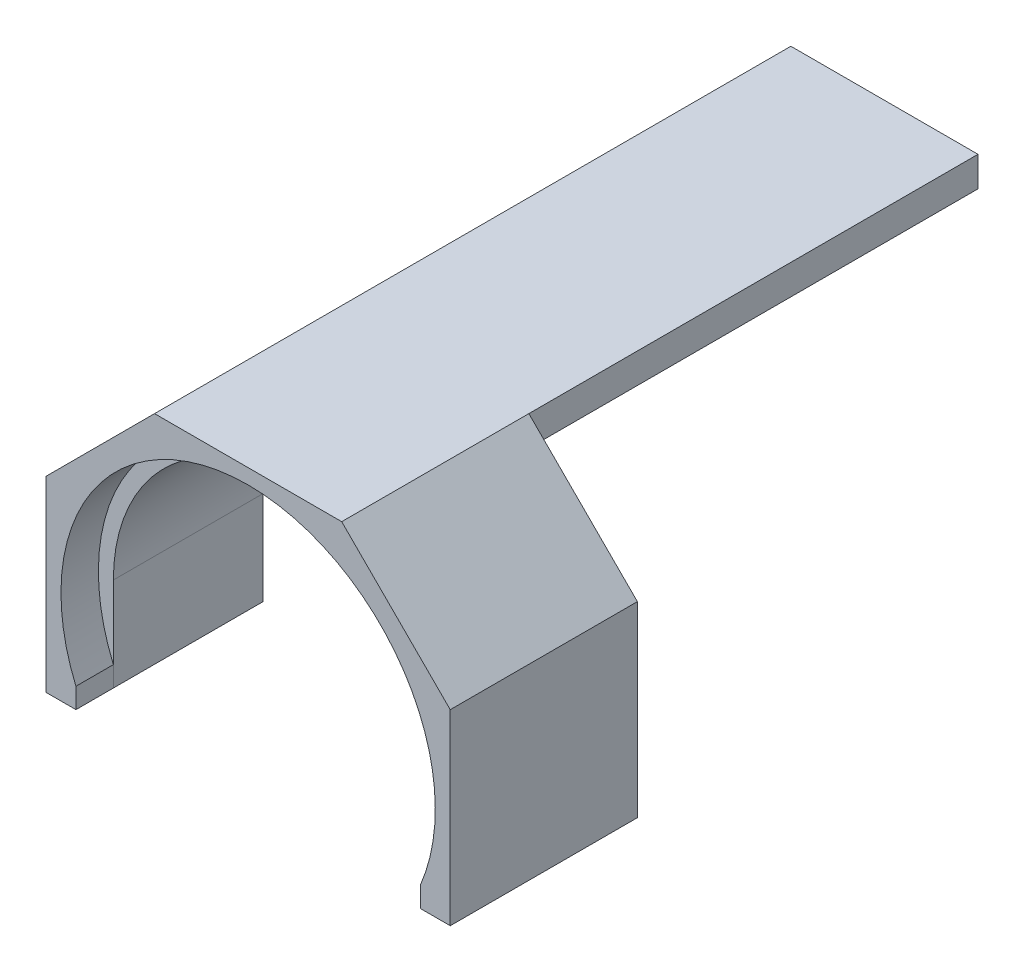
ISO-10303-21;
HEADER;
FILE_DESCRIPTION(('STEP AP214'),'2;1');
FILE_NAME('part.step','',(''),(''),'','','');
FILE_SCHEMA(('AUTOMOTIVE_DESIGN { 1 0 10303 214 1 1 1 1 }'));
ENDSEC;
DATA;
#1=APPLICATION_CONTEXT('core data for automotive mechanical design processes');
#2=APPLICATION_PROTOCOL_DEFINITION('international standard','automotive_design',2000,#1);
#3=PRODUCT_CONTEXT('',#1,'mechanical');
#4=PRODUCT('Part','Part','',(#3));
#5=PRODUCT_RELATED_PRODUCT_CATEGORY('part','',(#4));
#6=PRODUCT_DEFINITION_FORMATION('','',#4);
#7=PRODUCT_DEFINITION_CONTEXT('part definition',#1,'design');
#8=PRODUCT_DEFINITION('design','',#6,#7);
#9=PRODUCT_DEFINITION_SHAPE('','',#8);
#10=(LENGTH_UNIT() NAMED_UNIT(*) SI_UNIT(.MILLI.,.METRE.));
#11=(NAMED_UNIT(*) PLANE_ANGLE_UNIT() SI_UNIT($,.RADIAN.));
#12=(NAMED_UNIT(*) SI_UNIT($,.STERADIAN.) SOLID_ANGLE_UNIT());
#13=UNCERTAINTY_MEASURE_WITH_UNIT(LENGTH_MEASURE(1.E-05),#10,'distance_accuracy_value','');
#14=(GEOMETRIC_REPRESENTATION_CONTEXT(3) GLOBAL_UNCERTAINTY_ASSIGNED_CONTEXT((#13)) GLOBAL_UNIT_ASSIGNED_CONTEXT((#10,
#11,#12)) REPRESENTATION_CONTEXT('',''));
#15=CARTESIAN_POINT('',(0.,0.,0.));
#16=DIRECTION('',(0.,0.,1.));
#17=DIRECTION('',(1.,0.,0.));
#18=AXIS2_PLACEMENT_3D('',#15,#16,#17);
#19=CARTESIAN_POINT('',(0.,0.,160.));
#20=DIRECTION('',(0.,0.,1.));
#21=DIRECTION('',(1.,0.,0.));
#22=AXIS2_PLACEMENT_3D('',#19,#20,#21);
#23=PLANE('',#22);
#24=CARTESIAN_POINT('',(0.,-50.,160.));
#25=DIRECTION('',(0.,0.,-1.));
#26=DIRECTION('',(1.,0.,0.));
#27=AXIS2_PLACEMENT_3D('',#24,#25,#26);
#28=CIRCLE('',#27,50.);
#29=CARTESIAN_POINT('',(-46.0023323000082,-69.5849645146475,160.));
#30=VERTEX_POINT('',#29);
#31=CARTESIAN_POINT('',(46.,-69.5959179422654,160.));
#32=VERTEX_POINT('',#31);
#33=EDGE_CURVE('E54',#30,#32,#28,.T.);
#34=ORIENTED_EDGE('',*,*,#33,.F.);
#35=DIRECTION('',(0.,1.,0.));
#36=VECTOR('',#35,1.);
#37=CARTESIAN_POINT('',(-46.,-50.,160.));
#38=LINE('',#37,#36);
#39=CARTESIAN_POINT('',(-46.,-50.,160.));
#40=VERTEX_POINT('',#39);
#41=EDGE_CURVE('E175',#30,#40,#38,.T.);
#42=ORIENTED_EDGE('',*,*,#41,.T.);
#43=CARTESIAN_POINT('',(0.,-50.,160.));
#44=DIRECTION('',(0.,0.,-1.));
#45=DIRECTION('',(1.,0.,0.));
#46=AXIS2_PLACEMENT_3D('',#43,#44,#45);
#47=CIRCLE('',#46,46.);
#48=CARTESIAN_POINT('',(46.,-50.,160.));
#49=VERTEX_POINT('',#48);
#50=EDGE_CURVE('E402',#40,#49,#47,.T.);
#51=ORIENTED_EDGE('',*,*,#50,.T.);
#52=DIRECTION('',(0.,-1.,0.));
#53=VECTOR('',#52,1.);
#54=CARTESIAN_POINT('',(46.,-50.,160.));
#55=LINE('',#54,#53);
#56=EDGE_CURVE('E401',#49,#32,#55,.T.);
#57=ORIENTED_EDGE('',*,*,#56,.T.);
#58=EDGE_LOOP('',(#34,#42,#51,#57));
#59=FACE_BOUND('',#58,.T.);
#60=ADVANCED_FACE('F36',(#59),#23,.T.);
#61=CARTESIAN_POINT('',(-25.,4.,0.));
#62=DIRECTION('',(-1.,0.,0.));
#63=DIRECTION('',(0.,0.,1.));
#64=AXIS2_PLACEMENT_3D('',#61,#62,#63);
#65=PLANE('',#64);
#66=DIRECTION('',(0.,0.,1.));
#67=VECTOR('',#66,1.);
#68=CARTESIAN_POINT('',(-25.,-4.,0.));
#69=LINE('',#68,#67);
#70=CARTESIAN_POINT('',(-25.,-4.,0.));
#71=VERTEX_POINT('',#70);
#72=CARTESIAN_POINT('',(-25.,-4.,120.));
#73=VERTEX_POINT('',#72);
#74=EDGE_CURVE('E358',#71,#73,#69,.T.);
#75=ORIENTED_EDGE('',*,*,#74,.T.);
#76=DIRECTION('',(0.,1.,0.));
#77=VECTOR('',#76,1.);
#78=CARTESIAN_POINT('',(-25.,4.,120.));
#79=LINE('',#78,#77);
#80=CARTESIAN_POINT('',(-25.,4.,120.));
#81=VERTEX_POINT('',#80);
#82=EDGE_CURVE('E351',#73,#81,#79,.T.);
#83=ORIENTED_EDGE('',*,*,#82,.T.);
#84=DIRECTION('',(0.,0.,1.));
#85=VECTOR('',#84,1.);
#86=CARTESIAN_POINT('',(-25.,4.,0.));
#87=LINE('',#86,#85);
#88=CARTESIAN_POINT('',(-25.,4.,0.));
#89=VERTEX_POINT('',#88);
#90=EDGE_CURVE('E361',#89,#81,#87,.T.);
#91=ORIENTED_EDGE('',*,*,#90,.F.);
#92=DIRECTION('',(0.,-1.,0.));
#93=VECTOR('',#92,1.);
#94=CARTESIAN_POINT('',(-25.,4.,0.));
#95=LINE('',#94,#93);
#96=EDGE_CURVE('E354',#89,#71,#95,.T.);
#97=ORIENTED_EDGE('',*,*,#96,.T.);
#98=EDGE_LOOP('',(#75,#83,#91,#97));
#99=FACE_BOUND('',#98,.T.);
#100=ADVANCED_FACE('F267',(#99),#65,.T.);
#101=CARTESIAN_POINT('',(-25.,-4.,0.));
#102=DIRECTION('',(0.,-1.,0.));
#103=DIRECTION('',(1.,0.,0.));
#104=AXIS2_PLACEMENT_3D('',#101,#102,#103);
#105=PLANE('',#104);
#106=DIRECTION('',(0.,0.,1.));
#107=VECTOR('',#106,1.);
#108=CARTESIAN_POINT('',(25.,-4.,0.));
#109=LINE('',#108,#107);
#110=CARTESIAN_POINT('',(25.,-4.,0.));
#111=VERTEX_POINT('',#110);
#112=CARTESIAN_POINT('',(25.,-4.,120.));
#113=VERTEX_POINT('',#112);
#114=EDGE_CURVE('E46',#111,#113,#109,.T.);
#115=ORIENTED_EDGE('',*,*,#114,.T.);
#116=DIRECTION('',(-1.,0.,0.));
#117=VECTOR('',#116,1.);
#118=CARTESIAN_POINT('',(-25.,-4.,120.));
#119=LINE('',#118,#117);
#120=CARTESIAN_POINT('',(0.,-4.,120.));
#121=VERTEX_POINT('',#120);
#122=EDGE_CURVE('E347',#113,#121,#119,.T.);
#123=ORIENTED_EDGE('',*,*,#122,.T.);
#124=EDGE_CURVE('E350',#121,#73,#119,.T.);
#125=ORIENTED_EDGE('',*,*,#124,.T.);
#126=ORIENTED_EDGE('',*,*,#74,.F.);
#127=DIRECTION('',(1.,0.,0.));
#128=VECTOR('',#127,1.);
#129=CARTESIAN_POINT('',(-25.,-4.,0.));
#130=LINE('',#129,#128);
#131=EDGE_CURVE('E357',#71,#111,#130,.T.);
#132=ORIENTED_EDGE('',*,*,#131,.T.);
#133=EDGE_LOOP('',(#115,#123,#125,#126,#132));
#134=FACE_BOUND('',#133,.T.);
#135=ADVANCED_FACE('F274',(#134),#105,.T.);
#136=CARTESIAN_POINT('',(25.,4.,0.));
#137=DIRECTION('',(1.,0.,0.));
#138=DIRECTION('',(0.,0.,-1.));
#139=AXIS2_PLACEMENT_3D('',#136,#137,#138);
#140=PLANE('',#139);
#141=DIRECTION('',(0.,0.,1.));
#142=VECTOR('',#141,1.);
#143=CARTESIAN_POINT('',(25.,4.,0.));
#144=LINE('',#143,#142);
#145=CARTESIAN_POINT('',(25.,4.,0.));
#146=VERTEX_POINT('',#145);
#147=CARTESIAN_POINT('',(25.,4.,120.));
#148=VERTEX_POINT('',#147);
#149=EDGE_CURVE('E11',#146,#148,#144,.T.);
#150=ORIENTED_EDGE('',*,*,#149,.T.);
#151=DIRECTION('',(0.,-1.,0.));
#152=VECTOR('',#151,1.);
#153=CARTESIAN_POINT('',(25.,4.,120.));
#154=LINE('',#153,#152);
#155=EDGE_CURVE('E331',#148,#113,#154,.T.);
#156=ORIENTED_EDGE('',*,*,#155,.T.);
#157=ORIENTED_EDGE('',*,*,#114,.F.);
#158=DIRECTION('',(0.,1.,0.));
#159=VECTOR('',#158,1.);
#160=CARTESIAN_POINT('',(25.,4.,0.));
#161=LINE('',#160,#159);
#162=EDGE_CURVE('E366',#111,#146,#161,.T.);
#163=ORIENTED_EDGE('',*,*,#162,.T.);
#164=EDGE_LOOP('',(#150,#156,#157,#163));
#165=FACE_BOUND('',#164,.T.);
#166=ADVANCED_FACE('F271',(#165),#140,.T.);
#167=CARTESIAN_POINT('',(0.,0.,0.));
#168=DIRECTION('',(0.,0.,1.));
#169=DIRECTION('',(1.,0.,0.));
#170=AXIS2_PLACEMENT_3D('',#167,#168,#169);
#171=PLANE('',#170);
#172=ORIENTED_EDGE('',*,*,#96,.F.);
#173=DIRECTION('',(-1.,0.,0.));
#174=VECTOR('',#173,1.);
#175=CARTESIAN_POINT('',(-25.,4.,0.));
#176=LINE('',#175,#174);
#177=EDGE_CURVE('E62',#146,#89,#176,.T.);
#178=ORIENTED_EDGE('',*,*,#177,.F.);
#179=ORIENTED_EDGE('',*,*,#162,.F.);
#180=ORIENTED_EDGE('',*,*,#131,.F.);
#181=EDGE_LOOP('',(#172,#178,#179,#180));
#182=FACE_BOUND('',#181,.T.);
#183=ADVANCED_FACE('F38',(#182),#171,.F.);
#184=CARTESIAN_POINT('',(-25.,4.,0.));
#185=DIRECTION('',(0.,1.,0.));
#186=DIRECTION('',(0.,0.,1.));
#187=AXIS2_PLACEMENT_3D('',#184,#185,#186);
#188=PLANE('',#187);
#189=DIRECTION('',(0.,0.,1.));
#190=VECTOR('',#189,1.);
#191=CARTESIAN_POINT('',(25.,4.,120.));
#192=LINE('',#191,#190);
#193=CARTESIAN_POINT('',(25.,4.,170.));
#194=VERTEX_POINT('',#193);
#195=EDGE_CURVE('E329',#148,#194,#192,.T.);
#196=ORIENTED_EDGE('',*,*,#195,.F.);
#197=ORIENTED_EDGE('',*,*,#149,.F.);
#198=ORIENTED_EDGE('',*,*,#177,.T.);
#199=ORIENTED_EDGE('',*,*,#90,.T.);
#200=DIRECTION('',(0.,0.,1.));
#201=VECTOR('',#200,1.);
#202=CARTESIAN_POINT('',(-25.,4.,120.));
#203=LINE('',#202,#201);
#204=CARTESIAN_POINT('',(-25.,4.,170.));
#205=VERTEX_POINT('',#204);
#206=EDGE_CURVE('E342',#81,#205,#203,.T.);
#207=ORIENTED_EDGE('',*,*,#206,.T.);
#208=DIRECTION('',(-1.,0.,0.));
#209=VECTOR('',#208,1.);
#210=CARTESIAN_POINT('',(-25.,4.,170.));
#211=LINE('',#210,#209);
#212=EDGE_CURVE('E312',#194,#205,#211,.T.);
#213=ORIENTED_EDGE('',*,*,#212,.F.);
#214=EDGE_LOOP('',(#196,#197,#198,#199,#207,#213));
#215=FACE_BOUND('',#214,.T.);
#216=ADVANCED_FACE('F228',(#215),#188,.T.);
#217=CARTESIAN_POINT('',(0.,-50.,120.));
#218=DIRECTION('',(0.,0.,1.));
#219=DIRECTION('',(1.,0.,0.));
#220=AXIS2_PLACEMENT_3D('',#217,#218,#219);
#221=CYLINDRICAL_SURFACE('',#220,46.);
#222=CARTESIAN_POINT('',(0.,-50.,120.));
#223=DIRECTION('',(0.,0.,-1.));
#224=DIRECTION('',(1.,0.,0.));
#225=AXIS2_PLACEMENT_3D('',#222,#223,#224);
#226=CIRCLE('',#225,46.);
#227=CARTESIAN_POINT('',(-46.,-50.,120.));
#228=VERTEX_POINT('',#227);
#229=EDGE_CURVE('E387',#228,#121,#226,.T.);
#230=ORIENTED_EDGE('',*,*,#229,.T.);
#231=CARTESIAN_POINT('',(46.,-50.,120.));
#232=VERTEX_POINT('',#231);
#233=EDGE_CURVE('E382',#121,#232,#226,.T.);
#234=ORIENTED_EDGE('',*,*,#233,.T.);
#235=DIRECTION('',(0.,0.,1.));
#236=VECTOR('',#235,1.);
#237=CARTESIAN_POINT('',(46.,-50.,120.));
#238=LINE('',#237,#236);
#239=EDGE_CURVE('E337',#232,#49,#238,.T.);
#240=ORIENTED_EDGE('',*,*,#239,.T.);
#241=ORIENTED_EDGE('',*,*,#50,.F.);
#242=DIRECTION('',(0.,0.,1.));
#243=VECTOR('',#242,1.);
#244=CARTESIAN_POINT('',(-46.,-50.,120.));
#245=LINE('',#244,#243);
#246=EDGE_CURVE('E339',#228,#40,#245,.T.);
#247=ORIENTED_EDGE('',*,*,#246,.F.);
#248=EDGE_LOOP('',(#230,#234,#240,#241,#247));
#249=FACE_BOUND('',#248,.T.);
#250=ADVANCED_FACE('F225',(#249),#221,.F.);
#251=CARTESIAN_POINT('',(0.,-50.,120.));
#252=DIRECTION('',(0.,0.,1.));
#253=DIRECTION('',(1.,0.,0.));
#254=AXIS2_PLACEMENT_3D('',#251,#252,#253);
#255=PLANE('',#254);
#256=ORIENTED_EDGE('',*,*,#82,.F.);
#257=ORIENTED_EDGE('',*,*,#124,.F.);
#258=ORIENTED_EDGE('',*,*,#229,.F.);
#259=DIRECTION('',(0.,1.,0.));
#260=VECTOR('',#259,1.);
#261=CARTESIAN_POINT('',(-46.,-50.,120.));
#262=LINE('',#261,#260);
#263=CARTESIAN_POINT('',(-46.,-75.,120.));
#264=VERTEX_POINT('',#263);
#265=EDGE_CURVE('E388',#264,#228,#262,.T.);
#266=ORIENTED_EDGE('',*,*,#265,.F.);
#267=DIRECTION('',(1.,0.,0.));
#268=VECTOR('',#267,1.);
#269=CARTESIAN_POINT('',(-54.,-75.,120.));
#270=LINE('',#269,#268);
#271=CARTESIAN_POINT('',(-54.,-75.,120.));
#272=VERTEX_POINT('',#271);
#273=EDGE_CURVE('E410',#272,#264,#270,.T.);
#274=ORIENTED_EDGE('',*,*,#273,.F.);
#275=DIRECTION('',(0.,-1.,0.));
#276=VECTOR('',#275,1.);
#277=CARTESIAN_POINT('',(-54.,-25.,120.));
#278=LINE('',#277,#276);
#279=CARTESIAN_POINT('',(-54.,-25.,120.));
#280=VERTEX_POINT('',#279);
#281=EDGE_CURVE('E297',#280,#272,#278,.T.);
#282=ORIENTED_EDGE('',*,*,#281,.F.);
#283=DIRECTION('',(-0.707106781186548,-0.707106781186548,0.));
#284=VECTOR('',#283,1.);
#285=CARTESIAN_POINT('',(-54.,-25.,120.));
#286=LINE('',#285,#284);
#287=EDGE_CURVE('E380',#81,#280,#286,.T.);
#288=ORIENTED_EDGE('',*,*,#287,.F.);
#289=EDGE_LOOP('',(#256,#257,#258,#266,#274,#282,#288));
#290=FACE_BOUND('',#289,.T.);
#291=ADVANCED_FACE('F209',(#290),#255,.F.);
#292=CARTESIAN_POINT('',(25.,4.,120.));
#293=DIRECTION('',(0.707106781186548,0.707106781186548,0.));
#294=DIRECTION('',(-0.707106781186548,0.707106781186548,0.));
#295=AXIS2_PLACEMENT_3D('',#292,#293,#294);
#296=PLANE('',#295);
#297=ORIENTED_EDGE('',*,*,#195,.T.);
#298=DIRECTION('',(-0.707106781186548,0.707106781186548,0.));
#299=VECTOR('',#298,1.);
#300=CARTESIAN_POINT('',(25.,4.,170.));
#301=LINE('',#300,#299);
#302=CARTESIAN_POINT('',(54.,-25.,170.));
#303=VERTEX_POINT('',#302);
#304=EDGE_CURVE('E314',#303,#194,#301,.T.);
#305=ORIENTED_EDGE('',*,*,#304,.F.);
#306=DIRECTION('',(0.,0.,1.));
#307=VECTOR('',#306,1.);
#308=CARTESIAN_POINT('',(54.,-25.,120.));
#309=LINE('',#308,#307);
#310=CARTESIAN_POINT('',(54.,-25.,120.));
#311=VERTEX_POINT('',#310);
#312=EDGE_CURVE('E325',#311,#303,#309,.T.);
#313=ORIENTED_EDGE('',*,*,#312,.F.);
#314=DIRECTION('',(-0.707106781186548,0.707106781186548,0.));
#315=VECTOR('',#314,1.);
#316=CARTESIAN_POINT('',(25.,4.,120.));
#317=LINE('',#316,#315);
#318=EDGE_CURVE('E344',#311,#148,#317,.T.);
#319=ORIENTED_EDGE('',*,*,#318,.T.);
#320=EDGE_LOOP('',(#297,#305,#313,#319));
#321=FACE_BOUND('',#320,.T.);
#322=ADVANCED_FACE('F210',(#321),#296,.T.);
#323=CARTESIAN_POINT('',(54.,-25.,120.));
#324=DIRECTION('',(1.,0.,0.));
#325=DIRECTION('',(0.,1.,0.));
#326=AXIS2_PLACEMENT_3D('',#323,#324,#325);
#327=PLANE('',#326);
#328=ORIENTED_EDGE('',*,*,#312,.T.);
#329=DIRECTION('',(0.,1.,0.));
#330=VECTOR('',#329,1.);
#331=CARTESIAN_POINT('',(54.,-25.,170.));
#332=LINE('',#331,#330);
#333=CARTESIAN_POINT('',(54.,-75.,170.));
#334=VERTEX_POINT('',#333);
#335=EDGE_CURVE('E317',#334,#303,#332,.T.);
#336=ORIENTED_EDGE('',*,*,#335,.F.);
#337=DIRECTION('',(0.,0.,1.));
#338=VECTOR('',#337,1.);
#339=CARTESIAN_POINT('',(54.,-75.,120.));
#340=LINE('',#339,#338);
#341=CARTESIAN_POINT('',(54.,-75.,120.));
#342=VERTEX_POINT('',#341);
#343=EDGE_CURVE('E323',#342,#334,#340,.T.);
#344=ORIENTED_EDGE('',*,*,#343,.F.);
#345=DIRECTION('',(0.,1.,0.));
#346=VECTOR('',#345,1.);
#347=CARTESIAN_POINT('',(54.,-25.,120.));
#348=LINE('',#347,#346);
#349=EDGE_CURVE('E326',#342,#311,#348,.T.);
#350=ORIENTED_EDGE('',*,*,#349,.T.);
#351=EDGE_LOOP('',(#328,#336,#344,#350));
#352=FACE_BOUND('',#351,.T.);
#353=ADVANCED_FACE('F213',(#352),#327,.T.);
#354=CARTESIAN_POINT('',(46.,-75.,120.));
#355=DIRECTION('',(0.,-1.,0.));
#356=DIRECTION('',(0.,0.,-1.));
#357=AXIS2_PLACEMENT_3D('',#354,#355,#356);
#358=PLANE('',#357);
#359=ORIENTED_EDGE('',*,*,#343,.T.);
#360=DIRECTION('',(1.,0.,0.));
#361=VECTOR('',#360,1.);
#362=CARTESIAN_POINT('',(54.,-75.,170.));
#363=LINE('',#362,#361);
#364=CARTESIAN_POINT('',(46.,-75.,170.));
#365=VERTEX_POINT('',#364);
#366=EDGE_CURVE('E163',#365,#334,#363,.T.);
#367=ORIENTED_EDGE('',*,*,#366,.F.);
#368=DIRECTION('',(0.,0.,1.));
#369=VECTOR('',#368,1.);
#370=CARTESIAN_POINT('',(46.,-75.,120.));
#371=LINE('',#370,#369);
#372=CARTESIAN_POINT('',(46.,-75.,120.));
#373=VERTEX_POINT('',#372);
#374=EDGE_CURVE('E159',#373,#365,#371,.T.);
#375=ORIENTED_EDGE('',*,*,#374,.F.);
#376=DIRECTION('',(1.,0.,0.));
#377=VECTOR('',#376,1.);
#378=CARTESIAN_POINT('',(46.,-75.,120.));
#379=LINE('',#378,#377);
#380=EDGE_CURVE('E393',#373,#342,#379,.T.);
#381=ORIENTED_EDGE('',*,*,#380,.T.);
#382=EDGE_LOOP('',(#359,#367,#375,#381));
#383=FACE_BOUND('',#382,.T.);
#384=ADVANCED_FACE('F217',(#383),#358,.T.);
#385=CARTESIAN_POINT('',(46.,-50.,120.));
#386=DIRECTION('',(-1.,0.,0.));
#387=DIRECTION('',(0.,0.,1.));
#388=AXIS2_PLACEMENT_3D('',#385,#386,#387);
#389=PLANE('',#388);
#390=ORIENTED_EDGE('',*,*,#56,.F.);
#391=ORIENTED_EDGE('',*,*,#239,.F.);
#392=DIRECTION('',(0.,-1.,0.));
#393=VECTOR('',#392,1.);
#394=CARTESIAN_POINT('',(46.,-50.,120.));
#395=LINE('',#394,#393);
#396=EDGE_CURVE('E385',#232,#373,#395,.T.);
#397=ORIENTED_EDGE('',*,*,#396,.T.);
#398=ORIENTED_EDGE('',*,*,#374,.T.);
#399=DIRECTION('',(0.,-1.,0.));
#400=VECTOR('',#399,1.);
#401=CARTESIAN_POINT('',(46.,-69.5959179422654,170.));
#402=LINE('',#401,#400);
#403=CARTESIAN_POINT('',(46.,-69.5959179422654,170.));
#404=VERTEX_POINT('',#403);
#405=EDGE_CURVE('E152',#404,#365,#402,.T.);
#406=ORIENTED_EDGE('',*,*,#405,.F.);
#407=DIRECTION('',(0.,0.,-1.));
#408=VECTOR('',#407,1.);
#409=CARTESIAN_POINT('',(46.,-69.5959179422654,170.));
#410=LINE('',#409,#408);
#411=EDGE_CURVE('E157',#404,#32,#410,.T.);
#412=ORIENTED_EDGE('',*,*,#411,.T.);
#413=EDGE_LOOP('',(#390,#391,#397,#398,#406,#412));
#414=FACE_BOUND('',#413,.T.);
#415=ADVANCED_FACE('F155',(#414),#389,.T.);
#416=CARTESIAN_POINT('',(-46.,-50.,120.));
#417=DIRECTION('',(1.,0.,0.));
#418=DIRECTION('',(0.,0.,-1.));
#419=AXIS2_PLACEMENT_3D('',#416,#417,#418);
#420=PLANE('',#419);
#421=CARTESIAN_POINT('',(-46.,-75.,160.));
#422=VERTEX_POINT('',#421);
#423=EDGE_CURVE('E40',#422,#30,#38,.T.);
#424=ORIENTED_EDGE('',*,*,#423,.F.);
#425=DIRECTION('',(0.,0.,1.));
#426=VECTOR('',#425,1.);
#427=CARTESIAN_POINT('',(-46.,-75.,120.));
#428=LINE('',#427,#426);
#429=EDGE_CURVE('E242',#264,#422,#428,.T.);
#430=ORIENTED_EDGE('',*,*,#429,.F.);
#431=ORIENTED_EDGE('',*,*,#265,.T.);
#432=ORIENTED_EDGE('',*,*,#246,.T.);
#433=ORIENTED_EDGE('',*,*,#41,.F.);
#434=EDGE_LOOP('',(#424,#430,#431,#432,#433));
#435=FACE_BOUND('',#434,.T.);
#436=ADVANCED_FACE('F224',(#435),#420,.T.);
#437=CARTESIAN_POINT('',(-54.,-75.,120.));
#438=DIRECTION('',(0.,-1.,0.));
#439=DIRECTION('',(0.,0.,-1.));
#440=AXIS2_PLACEMENT_3D('',#437,#438,#439);
#441=PLANE('',#440);
#442=ORIENTED_EDGE('',*,*,#429,.T.);
#443=DIRECTION('',(0.,0.,-1.));
#444=VECTOR('',#443,1.);
#445=CARTESIAN_POINT('',(-46.,-75.,170.));
#446=LINE('',#445,#444);
#447=CARTESIAN_POINT('',(-46.,-75.,170.));
#448=VERTEX_POINT('',#447);
#449=EDGE_CURVE('E176',#448,#422,#446,.T.);
#450=ORIENTED_EDGE('',*,*,#449,.F.);
#451=DIRECTION('',(1.,0.,0.));
#452=VECTOR('',#451,1.);
#453=CARTESIAN_POINT('',(-46.,-75.,170.));
#454=LINE('',#453,#452);
#455=CARTESIAN_POINT('',(-54.,-75.,170.));
#456=VERTEX_POINT('',#455);
#457=EDGE_CURVE('E304',#456,#448,#454,.T.);
#458=ORIENTED_EDGE('',*,*,#457,.F.);
#459=DIRECTION('',(0.,0.,1.));
#460=VECTOR('',#459,1.);
#461=CARTESIAN_POINT('',(-54.,-75.,120.));
#462=LINE('',#461,#460);
#463=EDGE_CURVE('E293',#272,#456,#462,.T.);
#464=ORIENTED_EDGE('',*,*,#463,.F.);
#465=ORIENTED_EDGE('',*,*,#273,.T.);
#466=EDGE_LOOP('',(#442,#450,#458,#464,#465));
#467=FACE_BOUND('',#466,.T.);
#468=ADVANCED_FACE('F233',(#467),#441,.T.);
#469=CARTESIAN_POINT('',(-54.,-25.,120.));
#470=DIRECTION('',(-1.,0.,0.));
#471=DIRECTION('',(0.,-1.,0.));
#472=AXIS2_PLACEMENT_3D('',#469,#470,#471);
#473=PLANE('',#472);
#474=ORIENTED_EDGE('',*,*,#463,.T.);
#475=DIRECTION('',(0.,-1.,0.));
#476=VECTOR('',#475,1.);
#477=CARTESIAN_POINT('',(-54.,-75.,170.));
#478=LINE('',#477,#476);
#479=CARTESIAN_POINT('',(-54.,-25.,170.));
#480=VERTEX_POINT('',#479);
#481=EDGE_CURVE('E295',#480,#456,#478,.T.);
#482=ORIENTED_EDGE('',*,*,#481,.F.);
#483=DIRECTION('',(0.,0.,1.));
#484=VECTOR('',#483,1.);
#485=CARTESIAN_POINT('',(-54.,-25.,120.));
#486=LINE('',#485,#484);
#487=EDGE_CURVE('E301',#280,#480,#486,.T.);
#488=ORIENTED_EDGE('',*,*,#487,.F.);
#489=ORIENTED_EDGE('',*,*,#281,.T.);
#490=EDGE_LOOP('',(#474,#482,#488,#489));
#491=FACE_BOUND('',#490,.T.);
#492=ADVANCED_FACE('F283',(#491),#473,.T.);
#493=CARTESIAN_POINT('',(-54.,-25.,120.));
#494=DIRECTION('',(-0.707106781186548,0.707106781186548,0.));
#495=DIRECTION('',(-0.707106781186548,-0.707106781186548,0.));
#496=AXIS2_PLACEMENT_3D('',#493,#494,#495);
#497=PLANE('',#496);
#498=ORIENTED_EDGE('',*,*,#487,.T.);
#499=DIRECTION('',(-0.707106781186548,-0.707106781186548,0.));
#500=VECTOR('',#499,1.);
#501=CARTESIAN_POINT('',(-54.,-25.,170.));
#502=LINE('',#501,#500);
#503=EDGE_CURVE('E308',#205,#480,#502,.T.);
#504=ORIENTED_EDGE('',*,*,#503,.F.);
#505=ORIENTED_EDGE('',*,*,#206,.F.);
#506=ORIENTED_EDGE('',*,*,#287,.T.);
#507=EDGE_LOOP('',(#498,#504,#505,#506));
#508=FACE_BOUND('',#507,.T.);
#509=ADVANCED_FACE('F207',(#508),#497,.T.);
#510=ORIENTED_EDGE('',*,*,#122,.F.);
#511=ORIENTED_EDGE('',*,*,#155,.F.);
#512=ORIENTED_EDGE('',*,*,#318,.F.);
#513=ORIENTED_EDGE('',*,*,#349,.F.);
#514=ORIENTED_EDGE('',*,*,#380,.F.);
#515=ORIENTED_EDGE('',*,*,#396,.F.);
#516=ORIENTED_EDGE('',*,*,#233,.F.);
#517=EDGE_LOOP('',(#510,#511,#512,#513,#514,#515,#516));
#518=FACE_BOUND('',#517,.T.);
#519=ADVANCED_FACE('F204',(#518),#255,.F.);
#520=CARTESIAN_POINT('',(0.,-50.,170.));
#521=DIRECTION('',(0.,0.,-1.));
#522=DIRECTION('',(-1.,0.,0.));
#523=AXIS2_PLACEMENT_3D('',#520,#521,#522);
#524=CYLINDRICAL_SURFACE('',#523,50.);
#525=ORIENTED_EDGE('',*,*,#33,.T.);
#526=ORIENTED_EDGE('',*,*,#411,.F.);
#527=CARTESIAN_POINT('',(0.,-50.,170.));
#528=DIRECTION('',(0.,0.,-1.));
#529=DIRECTION('',(1.,0.,0.));
#530=AXIS2_PLACEMENT_3D('',#527,#528,#529);
#531=CIRCLE('',#530,50.);
#532=CARTESIAN_POINT('',(-46.0046646000164,-69.5849645146475,170.));
#533=VERTEX_POINT('',#532);
#534=EDGE_CURVE('E164',#533,#404,#531,.T.);
#535=ORIENTED_EDGE('',*,*,#534,.F.);
#536=DIRECTION('',(0.,0.,-1.));
#537=VECTOR('',#536,1.);
#538=CARTESIAN_POINT('',(-46.0046646000164,-69.5849645146475,170.));
#539=LINE('',#538,#537);
#540=EDGE_CURVE('E179',#533,#30,#539,.T.);
#541=ORIENTED_EDGE('',*,*,#540,.T.);
#542=EDGE_LOOP('',(#525,#526,#535,#541));
#543=FACE_BOUND('',#542,.T.);
#544=ADVANCED_FACE('F174',(#543),#524,.F.);
#545=CARTESIAN_POINT('',(-46.0046646000164,-69.5849645146475,170.));
#546=DIRECTION('',(-0.999999628981156,-0.000861416014415323,0.));
#547=DIRECTION('',(0.000861416014415323,-0.999999628981156,0.));
#548=AXIS2_PLACEMENT_3D('',#545,#546,#547);
#549=PLANE('',#548);
#550=ORIENTED_EDGE('',*,*,#423,.T.);
#551=ORIENTED_EDGE('',*,*,#540,.F.);
#552=DIRECTION('',(-0.000861416014415323,0.999999628981156,0.));
#553=VECTOR('',#552,1.);
#554=CARTESIAN_POINT('',(-46.0046646000164,-69.5849645146475,170.));
#555=LINE('',#554,#553);
#556=EDGE_CURVE('E169',#448,#533,#555,.T.);
#557=ORIENTED_EDGE('',*,*,#556,.F.);
#558=ORIENTED_EDGE('',*,*,#449,.T.);
#559=EDGE_LOOP('',(#550,#551,#557,#558));
#560=FACE_BOUND('',#559,.T.);
#561=ADVANCED_FACE('F192',(#560),#549,.F.);
#562=CARTESIAN_POINT('',(0.,-50.,170.));
#563=DIRECTION('',(0.,0.,1.));
#564=DIRECTION('',(1.,0.,0.));
#565=AXIS2_PLACEMENT_3D('',#562,#563,#564);
#566=PLANE('',#565);
#567=ORIENTED_EDGE('',*,*,#534,.T.);
#568=ORIENTED_EDGE('',*,*,#405,.T.);
#569=ORIENTED_EDGE('',*,*,#366,.T.);
#570=ORIENTED_EDGE('',*,*,#335,.T.);
#571=ORIENTED_EDGE('',*,*,#304,.T.);
#572=ORIENTED_EDGE('',*,*,#212,.T.);
#573=ORIENTED_EDGE('',*,*,#503,.T.);
#574=ORIENTED_EDGE('',*,*,#481,.T.);
#575=ORIENTED_EDGE('',*,*,#457,.T.);
#576=ORIENTED_EDGE('',*,*,#556,.T.);
#577=EDGE_LOOP('',(#567,#568,#569,#570,#571,#572,#573,#574,#575,#576));
#578=FACE_BOUND('',#577,.T.);
#579=ADVANCED_FACE('F167',(#578),#566,.T.);
#580=CLOSED_SHELL('',(#60,#100,#135,#166,#183,#216,#250,#291,#322,#353,#384,#415,#436,#468,#492,
#509,#519,#544,#561,#579));
#581=MANIFOLD_SOLID_BREP('B2',#580);
#582=ADVANCED_BREP_SHAPE_REPRESENTATION('',(#18,#581),#14);
#583=SHAPE_DEFINITION_REPRESENTATION(#9,#582);
ENDSEC;
END-ISO-10303-21;
